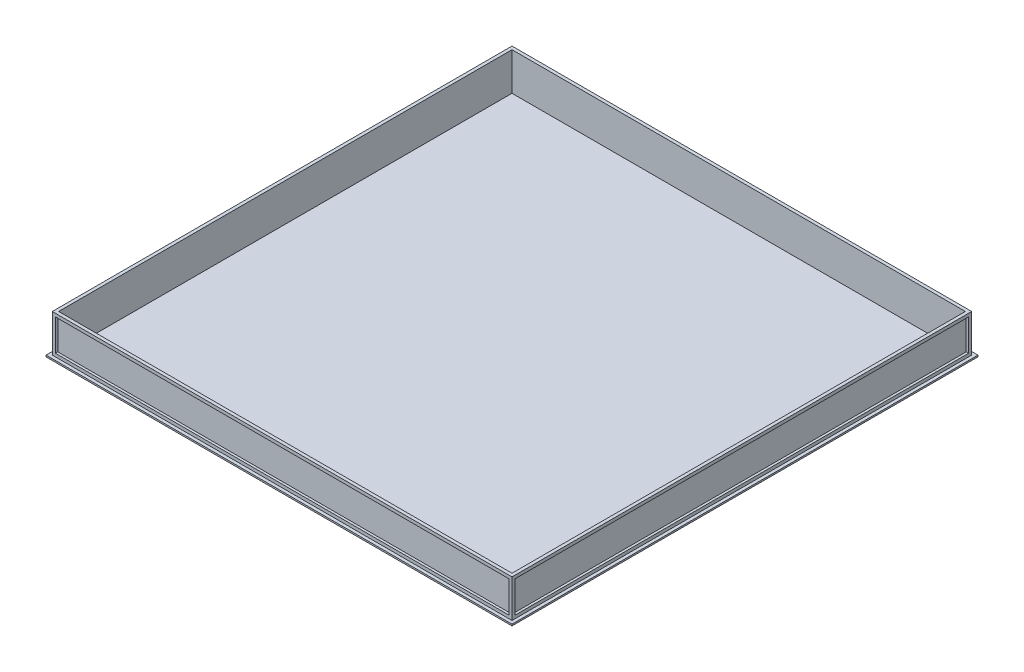
ISO-10303-21;
HEADER;
FILE_DESCRIPTION(('STEP AP214'),'2;1');
FILE_NAME('part.step','',(''),(''),'','','');
FILE_SCHEMA(('AUTOMOTIVE_DESIGN { 1 0 10303 214 1 1 1 1 }'));
ENDSEC;
DATA;
#1=APPLICATION_CONTEXT('core data for automotive mechanical design processes');
#2=APPLICATION_PROTOCOL_DEFINITION('international standard','automotive_design',2000,#1);
#3=PRODUCT_CONTEXT('',#1,'mechanical');
#4=PRODUCT('Part','Part','',(#3));
#5=PRODUCT_RELATED_PRODUCT_CATEGORY('part','',(#4));
#6=PRODUCT_DEFINITION_FORMATION('','',#4);
#7=PRODUCT_DEFINITION_CONTEXT('part definition',#1,'design');
#8=PRODUCT_DEFINITION('design','',#6,#7);
#9=PRODUCT_DEFINITION_SHAPE('','',#8);
#10=(LENGTH_UNIT() NAMED_UNIT(*) SI_UNIT(.MILLI.,.METRE.));
#11=(NAMED_UNIT(*) PLANE_ANGLE_UNIT() SI_UNIT($,.RADIAN.));
#12=(NAMED_UNIT(*) SI_UNIT($,.STERADIAN.) SOLID_ANGLE_UNIT());
#13=UNCERTAINTY_MEASURE_WITH_UNIT(LENGTH_MEASURE(1.E-05),#10,'distance_accuracy_value','');
#14=(GEOMETRIC_REPRESENTATION_CONTEXT(3) GLOBAL_UNCERTAINTY_ASSIGNED_CONTEXT((#13)) GLOBAL_UNIT_ASSIGNED_CONTEXT((#10,
#11,#12)) REPRESENTATION_CONTEXT('',''));
#15=CARTESIAN_POINT('',(0.,0.,0.));
#16=DIRECTION('',(0.,0.,1.));
#17=DIRECTION('',(1.,0.,0.));
#18=AXIS2_PLACEMENT_3D('',#15,#16,#17);
#19=CARTESIAN_POINT('',(-1879.6,-12.7,-1879.6));
#20=DIRECTION('',(0.,1.,0.));
#21=DIRECTION('',(0.,0.,1.));
#22=AXIS2_PLACEMENT_3D('',#19,#20,#21);
#23=PLANE('',#22);
#24=DIRECTION('',(1.,0.,0.));
#25=VECTOR('',#24,1.);
#26=CARTESIAN_POINT('',(0.,-12.7,1879.6));
#27=LINE('',#26,#25);
#28=CARTESIAN_POINT('',(-1879.6,-12.7,1879.6));
#29=VERTEX_POINT('',#28);
#30=CARTESIAN_POINT('',(1879.6,-12.7,1879.6));
#31=VERTEX_POINT('',#30);
#32=EDGE_CURVE('E213',#29,#31,#27,.T.);
#33=ORIENTED_EDGE('',*,*,#32,.F.);
#34=DIRECTION('',(0.,0.,1.));
#35=VECTOR('',#34,1.);
#36=CARTESIAN_POINT('',(-1879.6,-12.7,0.));
#37=LINE('',#36,#35);
#38=CARTESIAN_POINT('',(-1879.6,-12.7,-1879.6));
#39=VERTEX_POINT('',#38);
#40=EDGE_CURVE('E200',#39,#29,#37,.T.);
#41=ORIENTED_EDGE('',*,*,#40,.F.);
#42=DIRECTION('',(-1.,0.,0.));
#43=VECTOR('',#42,1.);
#44=CARTESIAN_POINT('',(0.,-12.7,-1879.6));
#45=LINE('',#44,#43);
#46=CARTESIAN_POINT('',(1879.6,-12.7,-1879.6));
#47=VERTEX_POINT('',#46);
#48=EDGE_CURVE('E21',#47,#39,#45,.T.);
#49=ORIENTED_EDGE('',*,*,#48,.F.);
#50=DIRECTION('',(0.,0.,-1.));
#51=VECTOR('',#50,1.);
#52=CARTESIAN_POINT('',(1879.6,-12.7,0.));
#53=LINE('',#52,#51);
#54=EDGE_CURVE('E228',#31,#47,#53,.T.);
#55=ORIENTED_EDGE('',*,*,#54,.F.);
#56=EDGE_LOOP('',(#33,#41,#49,#55));
#57=FACE_BOUND('',#56,.T.);
#58=ADVANCED_FACE('F17',(#57),#23,.F.);
#59=CARTESIAN_POINT('',(-1828.8,25.4,1835.15));
#60=DIRECTION('',(0.,0.,1.));
#61=DIRECTION('',(1.,0.,0.));
#62=AXIS2_PLACEMENT_3D('',#59,#60,#61);
#63=PLANE('',#62);
#64=DIRECTION('',(1.,0.,0.));
#65=VECTOR('',#64,1.);
#66=CARTESIAN_POINT('',(0.,25.4,1835.15));
#67=LINE('',#66,#65);
#68=CARTESIAN_POINT('',(-1828.8,25.4,1835.15));
#69=VERTEX_POINT('',#68);
#70=CARTESIAN_POINT('',(1828.8,25.4,1835.15));
#71=VERTEX_POINT('',#70);
#72=EDGE_CURVE('E230',#69,#71,#67,.T.);
#73=ORIENTED_EDGE('',*,*,#72,.T.);
#74=DIRECTION('',(0.,-1.,0.));
#75=VECTOR('',#74,1.);
#76=CARTESIAN_POINT('',(1828.8,152.4,1835.15));
#77=LINE('',#76,#75);
#78=CARTESIAN_POINT('',(1828.8,279.4,1835.15));
#79=VERTEX_POINT('',#78);
#80=EDGE_CURVE('E248',#79,#71,#77,.T.);
#81=ORIENTED_EDGE('',*,*,#80,.F.);
#82=DIRECTION('',(-1.,0.,0.));
#83=VECTOR('',#82,1.);
#84=CARTESIAN_POINT('',(0.,279.4,1835.15));
#85=LINE('',#84,#83);
#86=CARTESIAN_POINT('',(-1828.8,279.4,1835.15));
#87=VERTEX_POINT('',#86);
#88=EDGE_CURVE('E238',#79,#87,#85,.T.);
#89=ORIENTED_EDGE('',*,*,#88,.T.);
#90=DIRECTION('',(0.,1.,0.));
#91=VECTOR('',#90,1.);
#92=CARTESIAN_POINT('',(-1828.8,152.4,1835.15));
#93=LINE('',#92,#91);
#94=EDGE_CURVE('E232',#69,#87,#93,.T.);
#95=ORIENTED_EDGE('',*,*,#94,.F.);
#96=EDGE_LOOP('',(#73,#81,#89,#95));
#97=FACE_BOUND('',#96,.T.);
#98=ADVANCED_FACE('F757',(#97),#63,.T.);
#99=CARTESIAN_POINT('',(1835.15,25.4,1828.8));
#100=DIRECTION('',(1.,0.,0.));
#101=DIRECTION('',(0.,0.,-1.));
#102=AXIS2_PLACEMENT_3D('',#99,#100,#101);
#103=PLANE('',#102);
#104=DIRECTION('',(0.,0.,-1.));
#105=VECTOR('',#104,1.);
#106=CARTESIAN_POINT('',(1835.15,25.4,0.));
#107=LINE('',#106,#105);
#108=CARTESIAN_POINT('',(1835.15,25.4,1828.8));
#109=VERTEX_POINT('',#108);
#110=CARTESIAN_POINT('',(1835.15,25.4,-1828.8));
#111=VERTEX_POINT('',#110);
#112=EDGE_CURVE('E254',#109,#111,#107,.T.);
#113=ORIENTED_EDGE('',*,*,#112,.T.);
#114=DIRECTION('',(0.,-1.,0.));
#115=VECTOR('',#114,1.);
#116=CARTESIAN_POINT('',(1835.15,152.4,-1828.8));
#117=LINE('',#116,#115);
#118=CARTESIAN_POINT('',(1835.15,279.4,-1828.8));
#119=VERTEX_POINT('',#118);
#120=EDGE_CURVE('E251',#119,#111,#117,.T.);
#121=ORIENTED_EDGE('',*,*,#120,.F.);
#122=DIRECTION('',(0.,0.,1.));
#123=VECTOR('',#122,1.);
#124=CARTESIAN_POINT('',(1835.15,279.4,0.));
#125=LINE('',#124,#123);
#126=CARTESIAN_POINT('',(1835.15,279.4,1828.8));
#127=VERTEX_POINT('',#126);
#128=EDGE_CURVE('E264',#119,#127,#125,.T.);
#129=ORIENTED_EDGE('',*,*,#128,.T.);
#130=DIRECTION('',(0.,1.,0.));
#131=VECTOR('',#130,1.);
#132=CARTESIAN_POINT('',(1835.15,152.4,1828.8));
#133=LINE('',#132,#131);
#134=EDGE_CURVE('E261',#109,#127,#133,.T.);
#135=ORIENTED_EDGE('',*,*,#134,.F.);
#136=EDGE_LOOP('',(#113,#121,#129,#135));
#137=FACE_BOUND('',#136,.T.);
#138=ADVANCED_FACE('F747',(#137),#103,.T.);
#139=CARTESIAN_POINT('',(1828.8,25.4,-1835.15));
#140=DIRECTION('',(0.,0.,-1.));
#141=DIRECTION('',(-1.,0.,0.));
#142=AXIS2_PLACEMENT_3D('',#139,#140,#141);
#143=PLANE('',#142);
#144=DIRECTION('',(-1.,0.,0.));
#145=VECTOR('',#144,1.);
#146=CARTESIAN_POINT('',(0.,25.4,-1835.15));
#147=LINE('',#146,#145);
#148=CARTESIAN_POINT('',(1828.8,25.4,-1835.15));
#149=VERTEX_POINT('',#148);
#150=CARTESIAN_POINT('',(-1828.8,25.4,-1835.15));
#151=VERTEX_POINT('',#150);
#152=EDGE_CURVE('E274',#149,#151,#147,.T.);
#153=ORIENTED_EDGE('',*,*,#152,.T.);
#154=DIRECTION('',(0.,-1.,0.));
#155=VECTOR('',#154,1.);
#156=CARTESIAN_POINT('',(-1828.8,152.4,-1835.15));
#157=LINE('',#156,#155);
#158=CARTESIAN_POINT('',(-1828.8,279.4,-1835.15));
#159=VERTEX_POINT('',#158);
#160=EDGE_CURVE('E271',#159,#151,#157,.T.);
#161=ORIENTED_EDGE('',*,*,#160,.F.);
#162=DIRECTION('',(1.,0.,0.));
#163=VECTOR('',#162,1.);
#164=CARTESIAN_POINT('',(0.,279.4,-1835.15));
#165=LINE('',#164,#163);
#166=CARTESIAN_POINT('',(1828.8,279.4,-1835.15));
#167=VERTEX_POINT('',#166);
#168=EDGE_CURVE('E284',#159,#167,#165,.T.);
#169=ORIENTED_EDGE('',*,*,#168,.T.);
#170=DIRECTION('',(0.,1.,0.));
#171=VECTOR('',#170,1.);
#172=CARTESIAN_POINT('',(1828.8,152.4,-1835.15));
#173=LINE('',#172,#171);
#174=EDGE_CURVE('E281',#149,#167,#173,.T.);
#175=ORIENTED_EDGE('',*,*,#174,.F.);
#176=EDGE_LOOP('',(#153,#161,#169,#175));
#177=FACE_BOUND('',#176,.T.);
#178=ADVANCED_FACE('F738',(#177),#143,.T.);
#179=CARTESIAN_POINT('',(1879.6,-12.7,-1879.6));
#180=DIRECTION('',(0.,0.,-1.));
#181=DIRECTION('',(-1.,0.,0.));
#182=AXIS2_PLACEMENT_3D('',#179,#180,#181);
#183=PLANE('',#182);
#184=DIRECTION('',(0.,1.,0.));
#185=VECTOR('',#184,1.);
#186=CARTESIAN_POINT('',(1879.6,-6.35,-1879.6));
#187=LINE('',#186,#185);
#188=CARTESIAN_POINT('',(1879.6,0.,-1879.6));
#189=VERTEX_POINT('',#188);
#190=EDGE_CURVE('E209',#47,#189,#187,.T.);
#191=ORIENTED_EDGE('',*,*,#190,.F.);
#192=ORIENTED_EDGE('',*,*,#48,.T.);
#193=DIRECTION('',(0.,-1.,0.));
#194=VECTOR('',#193,1.);
#195=CARTESIAN_POINT('',(-1879.6,-6.35,-1879.6));
#196=LINE('',#195,#194);
#197=CARTESIAN_POINT('',(-1879.6,0.,-1879.6));
#198=VERTEX_POINT('',#197);
#199=EDGE_CURVE('E206',#198,#39,#196,.T.);
#200=ORIENTED_EDGE('',*,*,#199,.F.);
#201=DIRECTION('',(-1.,0.,0.));
#202=VECTOR('',#201,1.);
#203=CARTESIAN_POINT('',(0.,0.,-1879.6));
#204=LINE('',#203,#202);
#205=EDGE_CURVE('E291',#189,#198,#204,.T.);
#206=ORIENTED_EDGE('',*,*,#205,.F.);
#207=EDGE_LOOP('',(#191,#192,#200,#206));
#208=FACE_BOUND('',#207,.T.);
#209=ADVANCED_FACE('F205',(#208),#183,.T.);
#210=CARTESIAN_POINT('',(-1879.6,-12.7,-1879.6));
#211=DIRECTION('',(-1.,0.,0.));
#212=DIRECTION('',(0.,0.,1.));
#213=AXIS2_PLACEMENT_3D('',#210,#211,#212);
#214=PLANE('',#213);
#215=ORIENTED_EDGE('',*,*,#199,.T.);
#216=ORIENTED_EDGE('',*,*,#40,.T.);
#217=DIRECTION('',(0.,-1.,0.));
#218=VECTOR('',#217,1.);
#219=CARTESIAN_POINT('',(-1879.6,-6.35,1879.6));
#220=LINE('',#219,#218);
#221=CARTESIAN_POINT('',(-1879.6,0.,1879.6));
#222=VERTEX_POINT('',#221);
#223=EDGE_CURVE('E215',#222,#29,#220,.T.);
#224=ORIENTED_EDGE('',*,*,#223,.F.);
#225=DIRECTION('',(0.,0.,1.));
#226=VECTOR('',#225,1.);
#227=CARTESIAN_POINT('',(-1879.6,0.,0.));
#228=LINE('',#227,#226);
#229=EDGE_CURVE('E219',#198,#222,#228,.T.);
#230=ORIENTED_EDGE('',*,*,#229,.F.);
#231=EDGE_LOOP('',(#215,#216,#224,#230));
#232=FACE_BOUND('',#231,.T.);
#233=ADVANCED_FACE('F217',(#232),#214,.T.);
#234=CARTESIAN_POINT('',(-1879.6,-12.7,1879.6));
#235=DIRECTION('',(0.,0.,1.));
#236=DIRECTION('',(1.,0.,0.));
#237=AXIS2_PLACEMENT_3D('',#234,#235,#236);
#238=PLANE('',#237);
#239=ORIENTED_EDGE('',*,*,#223,.T.);
#240=ORIENTED_EDGE('',*,*,#32,.T.);
#241=DIRECTION('',(0.,-1.,0.));
#242=VECTOR('',#241,1.);
#243=CARTESIAN_POINT('',(1879.6,-6.35,1879.6));
#244=LINE('',#243,#242);
#245=CARTESIAN_POINT('',(1879.6,0.,1879.6));
#246=VERTEX_POINT('',#245);
#247=EDGE_CURVE('E225',#246,#31,#244,.T.);
#248=ORIENTED_EDGE('',*,*,#247,.F.);
#249=DIRECTION('',(1.,0.,0.));
#250=VECTOR('',#249,1.);
#251=CARTESIAN_POINT('',(0.,0.,1879.6));
#252=LINE('',#251,#250);
#253=EDGE_CURVE('E294',#222,#246,#252,.T.);
#254=ORIENTED_EDGE('',*,*,#253,.F.);
#255=EDGE_LOOP('',(#239,#240,#248,#254));
#256=FACE_BOUND('',#255,.T.);
#257=ADVANCED_FACE('F711',(#256),#238,.T.);
#258=CARTESIAN_POINT('',(1879.6,-12.7,1879.6));
#259=DIRECTION('',(1.,0.,0.));
#260=DIRECTION('',(0.,0.,-1.));
#261=AXIS2_PLACEMENT_3D('',#258,#259,#260);
#262=PLANE('',#261);
#263=ORIENTED_EDGE('',*,*,#247,.T.);
#264=ORIENTED_EDGE('',*,*,#54,.T.);
#265=ORIENTED_EDGE('',*,*,#190,.T.);
#266=DIRECTION('',(0.,0.,-1.));
#267=VECTOR('',#266,1.);
#268=CARTESIAN_POINT('',(1879.6,0.,0.));
#269=LINE('',#268,#267);
#270=EDGE_CURVE('E297',#246,#189,#269,.T.);
#271=ORIENTED_EDGE('',*,*,#270,.F.);
#272=EDGE_LOOP('',(#263,#264,#265,#271));
#273=FACE_BOUND('',#272,.T.);
#274=ADVANCED_FACE('F701',(#273),#262,.T.);
#275=CARTESIAN_POINT('',(-1835.15,25.4,-1828.8));
#276=DIRECTION('',(-1.,0.,0.));
#277=DIRECTION('',(0.,0.,1.));
#278=AXIS2_PLACEMENT_3D('',#275,#276,#277);
#279=PLANE('',#278);
#280=DIRECTION('',(0.,0.,1.));
#281=VECTOR('',#280,1.);
#282=CARTESIAN_POINT('',(-1835.15,25.4,0.));
#283=LINE('',#282,#281);
#284=CARTESIAN_POINT('',(-1835.15,25.4,-1828.8));
#285=VERTEX_POINT('',#284);
#286=CARTESIAN_POINT('',(-1835.15,25.4,1828.8));
#287=VERTEX_POINT('',#286);
#288=EDGE_CURVE('E303',#285,#287,#283,.T.);
#289=ORIENTED_EDGE('',*,*,#288,.T.);
#290=DIRECTION('',(0.,-1.,0.));
#291=VECTOR('',#290,1.);
#292=CARTESIAN_POINT('',(-1835.15,152.4,1828.8));
#293=LINE('',#292,#291);
#294=CARTESIAN_POINT('',(-1835.15,279.4,1828.8));
#295=VERTEX_POINT('',#294);
#296=EDGE_CURVE('E300',#295,#287,#293,.T.);
#297=ORIENTED_EDGE('',*,*,#296,.F.);
#298=DIRECTION('',(0.,0.,-1.));
#299=VECTOR('',#298,1.);
#300=CARTESIAN_POINT('',(-1835.15,279.4,0.));
#301=LINE('',#300,#299);
#302=CARTESIAN_POINT('',(-1835.15,279.4,-1828.8));
#303=VERTEX_POINT('',#302);
#304=EDGE_CURVE('E313',#295,#303,#301,.T.);
#305=ORIENTED_EDGE('',*,*,#304,.T.);
#306=DIRECTION('',(0.,1.,0.));
#307=VECTOR('',#306,1.);
#308=CARTESIAN_POINT('',(-1835.15,152.4,-1828.8));
#309=LINE('',#308,#307);
#310=EDGE_CURVE('E310',#285,#303,#309,.T.);
#311=ORIENTED_EDGE('',*,*,#310,.F.);
#312=EDGE_LOOP('',(#289,#297,#305,#311));
#313=FACE_BOUND('',#312,.T.);
#314=ADVANCED_FACE('F691',(#313),#279,.T.);
#315=CARTESIAN_POINT('',(-1828.8,25.4,1854.2));
#316=DIRECTION('',(0.,-1.,0.));
#317=DIRECTION('',(0.,0.,-1.));
#318=AXIS2_PLACEMENT_3D('',#315,#316,#317);
#319=PLANE('',#318);
#320=ORIENTED_EDGE('',*,*,#72,.F.);
#321=DIRECTION('',(0.,0.,-1.));
#322=VECTOR('',#321,1.);
#323=CARTESIAN_POINT('',(-1828.8,25.4,1844.675));
#324=LINE('',#323,#322);
#325=CARTESIAN_POINT('',(-1828.8000000635,25.3999999746,1854.2));
#326=VERTEX_POINT('',#325);
#327=EDGE_CURVE('E235',#326,#69,#324,.T.);
#328=ORIENTED_EDGE('',*,*,#327,.F.);
#329=DIRECTION('',(-1.,0.,0.));
#330=VECTOR('',#329,1.);
#331=CARTESIAN_POINT('',(0.,25.3999998984,1854.2));
#332=LINE('',#331,#330);
#333=CARTESIAN_POINT('',(1828.8000000635,25.3999999746,1854.2));
#334=VERTEX_POINT('',#333);
#335=EDGE_CURVE('E322',#334,#326,#332,.T.);
#336=ORIENTED_EDGE('',*,*,#335,.F.);
#337=DIRECTION('',(0.,0.,1.));
#338=VECTOR('',#337,1.);
#339=CARTESIAN_POINT('',(1828.8,25.4,1844.675));
#340=LINE('',#339,#338);
#341=EDGE_CURVE('E242',#71,#334,#340,.T.);
#342=ORIENTED_EDGE('',*,*,#341,.F.);
#343=EDGE_LOOP('',(#320,#328,#336,#342));
#344=FACE_BOUND('',#343,.T.);
#345=ADVANCED_FACE('F681',(#344),#319,.F.);
#346=CARTESIAN_POINT('',(-1828.8,25.4,1854.2));
#347=DIRECTION('',(1.,0.,0.));
#348=DIRECTION('',(0.,0.,-1.));
#349=AXIS2_PLACEMENT_3D('',#346,#347,#348);
#350=PLANE('',#349);
#351=DIRECTION('',(0.,1.,0.));
#352=VECTOR('',#351,1.);
#353=CARTESIAN_POINT('',(-1828.800000254,152.4,1854.2));
#354=LINE('',#353,#352);
#355=CARTESIAN_POINT('',(-1828.8000000635,279.4000000254,1854.2));
#356=VERTEX_POINT('',#355);
#357=EDGE_CURVE('E325',#326,#356,#354,.T.);
#358=ORIENTED_EDGE('',*,*,#357,.F.);
#359=ORIENTED_EDGE('',*,*,#327,.T.);
#360=ORIENTED_EDGE('',*,*,#94,.T.);
#361=DIRECTION('',(0.,0.,1.));
#362=VECTOR('',#361,1.);
#363=CARTESIAN_POINT('',(-1828.8,279.4,1844.675));
#364=LINE('',#363,#362);
#365=EDGE_CURVE('E240',#87,#356,#364,.T.);
#366=ORIENTED_EDGE('',*,*,#365,.T.);
#367=EDGE_LOOP('',(#358,#359,#360,#366));
#368=FACE_BOUND('',#367,.T.);
#369=ADVANCED_FACE('F671',(#368),#350,.T.);
#370=CARTESIAN_POINT('',(-1828.8,279.4,1835.15));
#371=DIRECTION('',(0.,1.,0.));
#372=DIRECTION('',(0.,0.,1.));
#373=AXIS2_PLACEMENT_3D('',#370,#371,#372);
#374=PLANE('',#373);
#375=DIRECTION('',(1.,0.,0.));
#376=VECTOR('',#375,1.);
#377=CARTESIAN_POINT('',(0.,279.4000001016,1854.2));
#378=LINE('',#377,#376);
#379=CARTESIAN_POINT('',(1828.8000000635,279.4000000254,1854.2));
#380=VERTEX_POINT('',#379);
#381=EDGE_CURVE('E328',#356,#380,#378,.T.);
#382=ORIENTED_EDGE('',*,*,#381,.F.);
#383=ORIENTED_EDGE('',*,*,#365,.F.);
#384=ORIENTED_EDGE('',*,*,#88,.F.);
#385=DIRECTION('',(0.,0.,-1.));
#386=VECTOR('',#385,1.);
#387=CARTESIAN_POINT('',(1828.8,279.4,1844.675));
#388=LINE('',#387,#386);
#389=EDGE_CURVE('E245',#380,#79,#388,.T.);
#390=ORIENTED_EDGE('',*,*,#389,.F.);
#391=EDGE_LOOP('',(#382,#383,#384,#390));
#392=FACE_BOUND('',#391,.T.);
#393=ADVANCED_FACE('F661',(#392),#374,.F.);
#394=CARTESIAN_POINT('',(1828.8,25.4,1835.15));
#395=DIRECTION('',(-1.,0.,0.));
#396=DIRECTION('',(0.,0.,1.));
#397=AXIS2_PLACEMENT_3D('',#394,#395,#396);
#398=PLANE('',#397);
#399=ORIENTED_EDGE('',*,*,#389,.T.);
#400=ORIENTED_EDGE('',*,*,#80,.T.);
#401=ORIENTED_EDGE('',*,*,#341,.T.);
#402=DIRECTION('',(0.,-1.,0.));
#403=VECTOR('',#402,1.);
#404=CARTESIAN_POINT('',(1828.800000254,152.4,1854.2));
#405=LINE('',#404,#403);
#406=EDGE_CURVE('E331',#380,#334,#405,.T.);
#407=ORIENTED_EDGE('',*,*,#406,.F.);
#408=EDGE_LOOP('',(#399,#400,#401,#407));
#409=FACE_BOUND('',#408,.T.);
#410=ADVANCED_FACE('F651',(#409),#398,.T.);
#411=CARTESIAN_POINT('',(1835.15,25.4,-1828.8));
#412=DIRECTION('',(0.,0.,1.));
#413=DIRECTION('',(1.,0.,0.));
#414=AXIS2_PLACEMENT_3D('',#411,#412,#413);
#415=PLANE('',#414);
#416=DIRECTION('',(-1.,0.,0.));
#417=VECTOR('',#416,1.);
#418=CARTESIAN_POINT('',(1844.675,279.4,-1828.8));
#419=LINE('',#418,#417);
#420=CARTESIAN_POINT('',(1854.2,279.4000000254,-1828.8000000635));
#421=VERTEX_POINT('',#420);
#422=EDGE_CURVE('E268',#421,#119,#419,.T.);
#423=ORIENTED_EDGE('',*,*,#422,.T.);
#424=ORIENTED_EDGE('',*,*,#120,.T.);
#425=DIRECTION('',(1.,0.,0.));
#426=VECTOR('',#425,1.);
#427=CARTESIAN_POINT('',(1844.675,25.4,-1828.8));
#428=LINE('',#427,#426);
#429=CARTESIAN_POINT('',(1854.2,25.3999999746,-1828.8000000635));
#430=VERTEX_POINT('',#429);
#431=EDGE_CURVE('E256',#111,#430,#428,.T.);
#432=ORIENTED_EDGE('',*,*,#431,.T.);
#433=DIRECTION('',(0.,-1.,0.));
#434=VECTOR('',#433,1.);
#435=CARTESIAN_POINT('',(1854.2,152.4,-1828.800000254));
#436=LINE('',#435,#434);
#437=EDGE_CURVE('E339',#421,#430,#436,.T.);
#438=ORIENTED_EDGE('',*,*,#437,.F.);
#439=EDGE_LOOP('',(#423,#424,#432,#438));
#440=FACE_BOUND('',#439,.T.);
#441=ADVANCED_FACE('F641',(#440),#415,.T.);
#442=CARTESIAN_POINT('',(1835.15,25.4,-1828.8));
#443=DIRECTION('',(0.,-1.,0.));
#444=DIRECTION('',(1.,0.,0.));
#445=AXIS2_PLACEMENT_3D('',#442,#443,#444);
#446=PLANE('',#445);
#447=ORIENTED_EDGE('',*,*,#112,.F.);
#448=DIRECTION('',(-1.,0.,0.));
#449=VECTOR('',#448,1.);
#450=CARTESIAN_POINT('',(1844.675,25.4,1828.8));
#451=LINE('',#450,#449);
#452=CARTESIAN_POINT('',(1854.2,25.3999999746,1828.8000000635));
#453=VERTEX_POINT('',#452);
#454=EDGE_CURVE('E258',#453,#109,#451,.T.);
#455=ORIENTED_EDGE('',*,*,#454,.F.);
#456=DIRECTION('',(0.,0.,1.));
#457=VECTOR('',#456,1.);
#458=CARTESIAN_POINT('',(1854.2,25.3999998984,0.));
#459=LINE('',#458,#457);
#460=EDGE_CURVE('E342',#430,#453,#459,.T.);
#461=ORIENTED_EDGE('',*,*,#460,.F.);
#462=ORIENTED_EDGE('',*,*,#431,.F.);
#463=EDGE_LOOP('',(#447,#455,#461,#462));
#464=FACE_BOUND('',#463,.T.);
#465=ADVANCED_FACE('F631',(#464),#446,.F.);
#466=CARTESIAN_POINT('',(1854.2,25.4,1828.8));
#467=DIRECTION('',(0.,0.,-1.));
#468=DIRECTION('',(-1.,0.,0.));
#469=AXIS2_PLACEMENT_3D('',#466,#467,#468);
#470=PLANE('',#469);
#471=DIRECTION('',(1.,0.,0.));
#472=VECTOR('',#471,1.);
#473=CARTESIAN_POINT('',(1844.675,279.4,1828.8));
#474=LINE('',#473,#472);
#475=CARTESIAN_POINT('',(1854.2,279.4000000254,1828.8000000635));
#476=VERTEX_POINT('',#475);
#477=EDGE_CURVE('E266',#127,#476,#474,.T.);
#478=ORIENTED_EDGE('',*,*,#477,.T.);
#479=DIRECTION('',(0.,1.,0.));
#480=VECTOR('',#479,1.);
#481=CARTESIAN_POINT('',(1854.2,152.4,1828.800000254));
#482=LINE('',#481,#480);
#483=EDGE_CURVE('E345',#453,#476,#482,.T.);
#484=ORIENTED_EDGE('',*,*,#483,.F.);
#485=ORIENTED_EDGE('',*,*,#454,.T.);
#486=ORIENTED_EDGE('',*,*,#134,.T.);
#487=EDGE_LOOP('',(#478,#484,#485,#486));
#488=FACE_BOUND('',#487,.T.);
#489=ADVANCED_FACE('F621',(#488),#470,.T.);
#490=CARTESIAN_POINT('',(1835.15,279.4,-1828.8));
#491=DIRECTION('',(0.,1.,0.));
#492=DIRECTION('',(0.,0.,1.));
#493=AXIS2_PLACEMENT_3D('',#490,#491,#492);
#494=PLANE('',#493);
#495=DIRECTION('',(0.,0.,-1.));
#496=VECTOR('',#495,1.);
#497=CARTESIAN_POINT('',(1854.2,279.4000001016,0.));
#498=LINE('',#497,#496);
#499=EDGE_CURVE('E348',#476,#421,#498,.T.);
#500=ORIENTED_EDGE('',*,*,#499,.F.);
#501=ORIENTED_EDGE('',*,*,#477,.F.);
#502=ORIENTED_EDGE('',*,*,#128,.F.);
#503=ORIENTED_EDGE('',*,*,#422,.F.);
#504=EDGE_LOOP('',(#500,#501,#502,#503));
#505=FACE_BOUND('',#504,.T.);
#506=ADVANCED_FACE('F611',(#505),#494,.F.);
#507=CARTESIAN_POINT('',(-1828.8,25.4,-1835.15));
#508=DIRECTION('',(1.,0.,0.));
#509=DIRECTION('',(0.,0.,-1.));
#510=AXIS2_PLACEMENT_3D('',#507,#508,#509);
#511=PLANE('',#510);
#512=DIRECTION('',(0.,0.,1.));
#513=VECTOR('',#512,1.);
#514=CARTESIAN_POINT('',(-1828.8,279.4,-1844.675));
#515=LINE('',#514,#513);
#516=CARTESIAN_POINT('',(-1828.8000000635,279.4000000254,-1854.2));
#517=VERTEX_POINT('',#516);
#518=EDGE_CURVE('E288',#517,#159,#515,.T.);
#519=ORIENTED_EDGE('',*,*,#518,.T.);
#520=ORIENTED_EDGE('',*,*,#160,.T.);
#521=DIRECTION('',(0.,0.,-1.));
#522=VECTOR('',#521,1.);
#523=CARTESIAN_POINT('',(-1828.8,25.4,-1844.675));
#524=LINE('',#523,#522);
#525=CARTESIAN_POINT('',(-1828.8000000635,25.3999999746,-1854.2));
#526=VERTEX_POINT('',#525);
#527=EDGE_CURVE('E276',#151,#526,#524,.T.);
#528=ORIENTED_EDGE('',*,*,#527,.T.);
#529=DIRECTION('',(0.,-1.,0.));
#530=VECTOR('',#529,1.);
#531=CARTESIAN_POINT('',(-1828.800000254,152.4,-1854.2));
#532=LINE('',#531,#530);
#533=EDGE_CURVE('E356',#517,#526,#532,.T.);
#534=ORIENTED_EDGE('',*,*,#533,.F.);
#535=EDGE_LOOP('',(#519,#520,#528,#534));
#536=FACE_BOUND('',#535,.T.);
#537=ADVANCED_FACE('F601',(#536),#511,.T.);
#538=CARTESIAN_POINT('',(-1828.8,25.4,-1835.15));
#539=DIRECTION('',(0.,-1.,0.));
#540=DIRECTION('',(0.,0.,-1.));
#541=AXIS2_PLACEMENT_3D('',#538,#539,#540);
#542=PLANE('',#541);
#543=ORIENTED_EDGE('',*,*,#152,.F.);
#544=DIRECTION('',(0.,0.,1.));
#545=VECTOR('',#544,1.);
#546=CARTESIAN_POINT('',(1828.8,25.4,-1844.675));
#547=LINE('',#546,#545);
#548=CARTESIAN_POINT('',(1828.8000000635,25.3999999746,-1854.2));
#549=VERTEX_POINT('',#548);
#550=EDGE_CURVE('E278',#549,#149,#547,.T.);
#551=ORIENTED_EDGE('',*,*,#550,.F.);
#552=DIRECTION('',(1.,0.,0.));
#553=VECTOR('',#552,1.);
#554=CARTESIAN_POINT('',(0.,25.3999998984,-1854.2));
#555=LINE('',#554,#553);
#556=EDGE_CURVE('E359',#526,#549,#555,.T.);
#557=ORIENTED_EDGE('',*,*,#556,.F.);
#558=ORIENTED_EDGE('',*,*,#527,.F.);
#559=EDGE_LOOP('',(#543,#551,#557,#558));
#560=FACE_BOUND('',#559,.T.);
#561=ADVANCED_FACE('F591',(#560),#542,.F.);
#562=CARTESIAN_POINT('',(1828.8,25.4,-1854.2));
#563=DIRECTION('',(-1.,0.,0.));
#564=DIRECTION('',(0.,0.,1.));
#565=AXIS2_PLACEMENT_3D('',#562,#563,#564);
#566=PLANE('',#565);
#567=ORIENTED_EDGE('',*,*,#174,.T.);
#568=DIRECTION('',(0.,0.,-1.));
#569=VECTOR('',#568,1.);
#570=CARTESIAN_POINT('',(1828.8,279.4,-1844.675));
#571=LINE('',#570,#569);
#572=CARTESIAN_POINT('',(1828.8000000635,279.4000000254,-1854.2));
#573=VERTEX_POINT('',#572);
#574=EDGE_CURVE('E286',#167,#573,#571,.T.);
#575=ORIENTED_EDGE('',*,*,#574,.T.);
#576=DIRECTION('',(0.,1.,0.));
#577=VECTOR('',#576,1.);
#578=CARTESIAN_POINT('',(1828.800000254,152.4,-1854.2));
#579=LINE('',#578,#577);
#580=EDGE_CURVE('E362',#549,#573,#579,.T.);
#581=ORIENTED_EDGE('',*,*,#580,.F.);
#582=ORIENTED_EDGE('',*,*,#550,.T.);
#583=EDGE_LOOP('',(#567,#575,#581,#582));
#584=FACE_BOUND('',#583,.T.);
#585=ADVANCED_FACE('F581',(#584),#566,.T.);
#586=CARTESIAN_POINT('',(-1828.8,279.4,-1854.2));
#587=DIRECTION('',(0.,1.,0.));
#588=DIRECTION('',(0.,0.,1.));
#589=AXIS2_PLACEMENT_3D('',#586,#587,#588);
#590=PLANE('',#589);
#591=DIRECTION('',(-1.,0.,0.));
#592=VECTOR('',#591,1.);
#593=CARTESIAN_POINT('',(0.,279.4000001016,-1854.2));
#594=LINE('',#593,#592);
#595=EDGE_CURVE('E365',#573,#517,#594,.T.);
#596=ORIENTED_EDGE('',*,*,#595,.F.);
#597=ORIENTED_EDGE('',*,*,#574,.F.);
#598=ORIENTED_EDGE('',*,*,#168,.F.);
#599=ORIENTED_EDGE('',*,*,#518,.F.);
#600=EDGE_LOOP('',(#596,#597,#598,#599));
#601=FACE_BOUND('',#600,.T.);
#602=ADVANCED_FACE('F571',(#601),#590,.F.);
#603=CARTESIAN_POINT('',(-1879.6,0.,-1879.6));
#604=DIRECTION('',(0.,1.,0.));
#605=DIRECTION('',(0.,0.,1.));
#606=AXIS2_PLACEMENT_3D('',#603,#604,#605);
#607=PLANE('',#606);
#608=DIRECTION('',(1.,0.,0.));
#609=VECTOR('',#608,1.);
#610=CARTESIAN_POINT('',(0.,0.,1854.2));
#611=LINE('',#610,#609);
#612=CARTESIAN_POINT('',(-1854.1999995428,0.,1854.1999995428));
#613=VERTEX_POINT('',#612);
#614=CARTESIAN_POINT('',(1854.1999997714,0.,1854.1999997714));
#615=VERTEX_POINT('',#614);
#616=EDGE_CURVE('E320',#613,#615,#611,.T.);
#617=ORIENTED_EDGE('',*,*,#616,.F.);
#618=DIRECTION('',(0.,0.,1.));
#619=VECTOR('',#618,1.);
#620=CARTESIAN_POINT('',(-1854.2,0.,0.));
#621=LINE('',#620,#619);
#622=CARTESIAN_POINT('',(-1854.1999997714,0.,-1854.1999997714));
#623=VERTEX_POINT('',#622);
#624=EDGE_CURVE('E371',#623,#613,#621,.T.);
#625=ORIENTED_EDGE('',*,*,#624,.F.);
#626=DIRECTION('',(-1.,0.,0.));
#627=VECTOR('',#626,1.);
#628=CARTESIAN_POINT('',(0.,0.,-1854.2));
#629=LINE('',#628,#627);
#630=CARTESIAN_POINT('',(1854.1999997714,0.,-1854.1999997714));
#631=VERTEX_POINT('',#630);
#632=EDGE_CURVE('E354',#631,#623,#629,.T.);
#633=ORIENTED_EDGE('',*,*,#632,.F.);
#634=DIRECTION('',(0.,0.,-1.));
#635=VECTOR('',#634,1.);
#636=CARTESIAN_POINT('',(1854.2,0.,0.));
#637=LINE('',#636,#635);
#638=EDGE_CURVE('E337',#615,#631,#637,.T.);
#639=ORIENTED_EDGE('',*,*,#638,.F.);
#640=EDGE_LOOP('',(#617,#625,#633,#639));
#641=FACE_BOUND('',#640,.T.);
#642=ORIENTED_EDGE('',*,*,#253,.T.);
#643=ORIENTED_EDGE('',*,*,#270,.T.);
#644=ORIENTED_EDGE('',*,*,#205,.T.);
#645=ORIENTED_EDGE('',*,*,#229,.T.);
#646=EDGE_LOOP('',(#642,#643,#644,#645));
#647=FACE_BOUND('',#646,.T.);
#648=ADVANCED_FACE('F561',(#641,#647),#607,.T.);
#649=CARTESIAN_POINT('',(-1835.15,25.4,1828.8));
#650=DIRECTION('',(0.,0.,-1.));
#651=DIRECTION('',(-1.,0.,0.));
#652=AXIS2_PLACEMENT_3D('',#649,#650,#651);
#653=PLANE('',#652);
#654=DIRECTION('',(1.,0.,0.));
#655=VECTOR('',#654,1.);
#656=CARTESIAN_POINT('',(-1844.675,279.4,1828.8));
#657=LINE('',#656,#655);
#658=CARTESIAN_POINT('',(-1854.2,279.4000000254,1828.8000000635));
#659=VERTEX_POINT('',#658);
#660=EDGE_CURVE('E317',#659,#295,#657,.T.);
#661=ORIENTED_EDGE('',*,*,#660,.T.);
#662=ORIENTED_EDGE('',*,*,#296,.T.);
#663=DIRECTION('',(-1.,0.,0.));
#664=VECTOR('',#663,1.);
#665=CARTESIAN_POINT('',(-1844.675,25.4,1828.8));
#666=LINE('',#665,#664);
#667=CARTESIAN_POINT('',(-1854.2,25.3999999746,1828.8000000635));
#668=VERTEX_POINT('',#667);
#669=EDGE_CURVE('E305',#287,#668,#666,.T.);
#670=ORIENTED_EDGE('',*,*,#669,.T.);
#671=DIRECTION('',(0.,-1.,0.));
#672=VECTOR('',#671,1.);
#673=CARTESIAN_POINT('',(-1854.2,152.4,1828.800000254));
#674=LINE('',#673,#672);
#675=EDGE_CURVE('E377',#659,#668,#674,.T.);
#676=ORIENTED_EDGE('',*,*,#675,.F.);
#677=EDGE_LOOP('',(#661,#662,#670,#676));
#678=FACE_BOUND('',#677,.T.);
#679=ADVANCED_FACE('F551',(#678),#653,.T.);
#680=CARTESIAN_POINT('',(-1854.2,25.4,-1828.8));
#681=DIRECTION('',(0.,-1.,0.));
#682=DIRECTION('',(1.,0.,0.));
#683=AXIS2_PLACEMENT_3D('',#680,#681,#682);
#684=PLANE('',#683);
#685=ORIENTED_EDGE('',*,*,#288,.F.);
#686=DIRECTION('',(1.,0.,0.));
#687=VECTOR('',#686,1.);
#688=CARTESIAN_POINT('',(-1844.675,25.4,-1828.8));
#689=LINE('',#688,#687);
#690=CARTESIAN_POINT('',(-1854.2,25.3999999746,-1828.8000000635));
#691=VERTEX_POINT('',#690);
#692=EDGE_CURVE('E307',#691,#285,#689,.T.);
#693=ORIENTED_EDGE('',*,*,#692,.F.);
#694=DIRECTION('',(0.,0.,-1.));
#695=VECTOR('',#694,1.);
#696=CARTESIAN_POINT('',(-1854.2,25.3999998984,0.));
#697=LINE('',#696,#695);
#698=EDGE_CURVE('E380',#668,#691,#697,.T.);
#699=ORIENTED_EDGE('',*,*,#698,.F.);
#700=ORIENTED_EDGE('',*,*,#669,.F.);
#701=EDGE_LOOP('',(#685,#693,#699,#700));
#702=FACE_BOUND('',#701,.T.);
#703=ADVANCED_FACE('F541',(#702),#684,.F.);
#704=CARTESIAN_POINT('',(-1854.2,25.4,-1828.8));
#705=DIRECTION('',(0.,0.,1.));
#706=DIRECTION('',(1.,0.,0.));
#707=AXIS2_PLACEMENT_3D('',#704,#705,#706);
#708=PLANE('',#707);
#709=ORIENTED_EDGE('',*,*,#310,.T.);
#710=DIRECTION('',(-1.,0.,0.));
#711=VECTOR('',#710,1.);
#712=CARTESIAN_POINT('',(-1844.675,279.4,-1828.8));
#713=LINE('',#712,#711);
#714=CARTESIAN_POINT('',(-1854.2,279.4000000254,-1828.8000000635));
#715=VERTEX_POINT('',#714);
#716=EDGE_CURVE('E315',#303,#715,#713,.T.);
#717=ORIENTED_EDGE('',*,*,#716,.T.);
#718=DIRECTION('',(0.,1.,0.));
#719=VECTOR('',#718,1.);
#720=CARTESIAN_POINT('',(-1854.2,152.4,-1828.800000254));
#721=LINE('',#720,#719);
#722=EDGE_CURVE('E383',#691,#715,#721,.T.);
#723=ORIENTED_EDGE('',*,*,#722,.F.);
#724=ORIENTED_EDGE('',*,*,#692,.T.);
#725=EDGE_LOOP('',(#709,#717,#723,#724));
#726=FACE_BOUND('',#725,.T.);
#727=ADVANCED_FACE('F531',(#726),#708,.T.);
#728=CARTESIAN_POINT('',(-1854.2,279.4,-1828.8));
#729=DIRECTION('',(0.,1.,0.));
#730=DIRECTION('',(0.,0.,1.));
#731=AXIS2_PLACEMENT_3D('',#728,#729,#730);
#732=PLANE('',#731);
#733=DIRECTION('',(0.,0.,1.));
#734=VECTOR('',#733,1.);
#735=CARTESIAN_POINT('',(-1854.2,279.4000001016,0.));
#736=LINE('',#735,#734);
#737=EDGE_CURVE('E386',#715,#659,#736,.T.);
#738=ORIENTED_EDGE('',*,*,#737,.F.);
#739=ORIENTED_EDGE('',*,*,#716,.F.);
#740=ORIENTED_EDGE('',*,*,#304,.F.);
#741=ORIENTED_EDGE('',*,*,#660,.F.);
#742=EDGE_LOOP('',(#738,#739,#740,#741));
#743=FACE_BOUND('',#742,.T.);
#744=ADVANCED_FACE('F521',(#743),#732,.F.);
#745=CARTESIAN_POINT('',(-1854.2,0.,1854.2));
#746=DIRECTION('',(0.,0.,1.));
#747=DIRECTION('',(1.,0.,0.));
#748=AXIS2_PLACEMENT_3D('',#745,#746,#747);
#749=PLANE('',#748);
#750=ORIENTED_EDGE('',*,*,#381,.T.);
#751=ORIENTED_EDGE('',*,*,#406,.T.);
#752=ORIENTED_EDGE('',*,*,#335,.T.);
#753=ORIENTED_EDGE('',*,*,#357,.T.);
#754=EDGE_LOOP('',(#750,#751,#752,#753));
#755=FACE_BOUND('',#754,.T.);
#756=DIRECTION('',(0.,1.,0.));
#757=VECTOR('',#756,1.);
#758=CARTESIAN_POINT('',(-1854.2,152.4,1854.2));
#759=LINE('',#758,#757);
#760=CARTESIAN_POINT('',(-1854.2,304.8,1854.2));
#761=VERTEX_POINT('',#760);
#762=EDGE_CURVE('E374',#613,#761,#759,.T.);
#763=ORIENTED_EDGE('',*,*,#762,.F.);
#764=ORIENTED_EDGE('',*,*,#616,.T.);
#765=DIRECTION('',(0.,-1.,0.));
#766=VECTOR('',#765,1.);
#767=CARTESIAN_POINT('',(1854.2,152.4,1854.2));
#768=LINE('',#767,#766);
#769=CARTESIAN_POINT('',(1854.2,304.8,1854.2));
#770=VERTEX_POINT('',#769);
#771=EDGE_CURVE('E334',#770,#615,#768,.T.);
#772=ORIENTED_EDGE('',*,*,#771,.F.);
#773=DIRECTION('',(1.,0.,0.));
#774=VECTOR('',#773,1.);
#775=CARTESIAN_POINT('',(0.,304.8,1854.2));
#776=LINE('',#775,#774);
#777=EDGE_CURVE('E389',#761,#770,#776,.T.);
#778=ORIENTED_EDGE('',*,*,#777,.F.);
#779=EDGE_LOOP('',(#763,#764,#772,#778));
#780=FACE_BOUND('',#779,.T.);
#781=ADVANCED_FACE('F511',(#755,#780),#749,.T.);
#782=CARTESIAN_POINT('',(1854.2,0.,1854.2));
#783=DIRECTION('',(1.,0.,0.));
#784=DIRECTION('',(0.,0.,-1.));
#785=AXIS2_PLACEMENT_3D('',#782,#783,#784);
#786=PLANE('',#785);
#787=ORIENTED_EDGE('',*,*,#483,.T.);
#788=ORIENTED_EDGE('',*,*,#499,.T.);
#789=ORIENTED_EDGE('',*,*,#437,.T.);
#790=ORIENTED_EDGE('',*,*,#460,.T.);
#791=EDGE_LOOP('',(#787,#788,#789,#790));
#792=FACE_BOUND('',#791,.T.);
#793=ORIENTED_EDGE('',*,*,#638,.T.);
#794=DIRECTION('',(0.,-1.,0.));
#795=VECTOR('',#794,1.);
#796=CARTESIAN_POINT('',(1854.2,152.4,-1854.2));
#797=LINE('',#796,#795);
#798=CARTESIAN_POINT('',(1854.2,304.8,-1854.2));
#799=VERTEX_POINT('',#798);
#800=EDGE_CURVE('E351',#799,#631,#797,.T.);
#801=ORIENTED_EDGE('',*,*,#800,.F.);
#802=DIRECTION('',(0.,0.,-1.));
#803=VECTOR('',#802,1.);
#804=CARTESIAN_POINT('',(1854.2,304.8,0.));
#805=LINE('',#804,#803);
#806=EDGE_CURVE('E392',#770,#799,#805,.T.);
#807=ORIENTED_EDGE('',*,*,#806,.F.);
#808=ORIENTED_EDGE('',*,*,#771,.T.);
#809=EDGE_LOOP('',(#793,#801,#807,#808));
#810=FACE_BOUND('',#809,.T.);
#811=ADVANCED_FACE('F501',(#792,#810),#786,.T.);
#812=CARTESIAN_POINT('',(1854.2,0.,-1854.2));
#813=DIRECTION('',(0.,0.,-1.));
#814=DIRECTION('',(-1.,0.,0.));
#815=AXIS2_PLACEMENT_3D('',#812,#813,#814);
#816=PLANE('',#815);
#817=ORIENTED_EDGE('',*,*,#580,.T.);
#818=ORIENTED_EDGE('',*,*,#595,.T.);
#819=ORIENTED_EDGE('',*,*,#533,.T.);
#820=ORIENTED_EDGE('',*,*,#556,.T.);
#821=EDGE_LOOP('',(#817,#818,#819,#820));
#822=FACE_BOUND('',#821,.T.);
#823=ORIENTED_EDGE('',*,*,#632,.T.);
#824=DIRECTION('',(0.,-1.,0.));
#825=VECTOR('',#824,1.);
#826=CARTESIAN_POINT('',(-1854.2,152.4,-1854.2));
#827=LINE('',#826,#825);
#828=CARTESIAN_POINT('',(-1854.2,304.8,-1854.2));
#829=VERTEX_POINT('',#828);
#830=EDGE_CURVE('E368',#829,#623,#827,.T.);
#831=ORIENTED_EDGE('',*,*,#830,.F.);
#832=DIRECTION('',(-1.,0.,0.));
#833=VECTOR('',#832,1.);
#834=CARTESIAN_POINT('',(0.,304.8,-1854.2));
#835=LINE('',#834,#833);
#836=EDGE_CURVE('E395',#799,#829,#835,.T.);
#837=ORIENTED_EDGE('',*,*,#836,.F.);
#838=ORIENTED_EDGE('',*,*,#800,.T.);
#839=EDGE_LOOP('',(#823,#831,#837,#838));
#840=FACE_BOUND('',#839,.T.);
#841=ADVANCED_FACE('F491',(#822,#840),#816,.T.);
#842=CARTESIAN_POINT('',(-1854.2,0.,-1854.2));
#843=DIRECTION('',(-1.,0.,0.));
#844=DIRECTION('',(0.,0.,1.));
#845=AXIS2_PLACEMENT_3D('',#842,#843,#844);
#846=PLANE('',#845);
#847=ORIENTED_EDGE('',*,*,#722,.T.);
#848=ORIENTED_EDGE('',*,*,#737,.T.);
#849=ORIENTED_EDGE('',*,*,#675,.T.);
#850=ORIENTED_EDGE('',*,*,#698,.T.);
#851=EDGE_LOOP('',(#847,#848,#849,#850));
#852=FACE_BOUND('',#851,.T.);
#853=ORIENTED_EDGE('',*,*,#624,.T.);
#854=ORIENTED_EDGE('',*,*,#762,.T.);
#855=DIRECTION('',(0.,0.,1.));
#856=VECTOR('',#855,1.);
#857=CARTESIAN_POINT('',(-1854.2,304.8,0.));
#858=LINE('',#857,#856);
#859=EDGE_CURVE('E398',#829,#761,#858,.T.);
#860=ORIENTED_EDGE('',*,*,#859,.F.);
#861=ORIENTED_EDGE('',*,*,#830,.T.);
#862=EDGE_LOOP('',(#853,#854,#860,#861));
#863=FACE_BOUND('',#862,.T.);
#864=ADVANCED_FACE('F451',(#852,#863),#846,.T.);
#865=CARTESIAN_POINT('',(-1854.2,304.8,-1854.2));
#866=DIRECTION('',(0.,1.,0.));
#867=DIRECTION('',(0.,0.,1.));
#868=AXIS2_PLACEMENT_3D('',#865,#866,#867);
#869=PLANE('',#868);
#870=DIRECTION('',(1.,0.,0.));
#871=VECTOR('',#870,1.);
#872=CARTESIAN_POINT('',(0.,304.8,1828.8));
#873=LINE('',#872,#871);
#874=CARTESIAN_POINT('',(-1828.800000127,304.8,1828.800000127));
#875=VERTEX_POINT('',#874);
#876=CARTESIAN_POINT('',(1828.8000000635,304.8,1828.8000000635));
#877=VERTEX_POINT('',#876);
#878=EDGE_CURVE('E404',#875,#877,#873,.T.);
#879=ORIENTED_EDGE('',*,*,#878,.F.);
#880=DIRECTION('',(0.,0.,1.));
#881=VECTOR('',#880,1.);
#882=CARTESIAN_POINT('',(-1828.8,304.8,0.));
#883=LINE('',#882,#881);
#884=CARTESIAN_POINT('',(-1828.800000127,304.8,-1828.800000127));
#885=VERTEX_POINT('',#884);
#886=EDGE_CURVE('E401',#885,#875,#883,.T.);
#887=ORIENTED_EDGE('',*,*,#886,.F.);
#888=DIRECTION('',(-1.,0.,0.));
#889=VECTOR('',#888,1.);
#890=CARTESIAN_POINT('',(0.,304.8,-1828.8));
#891=LINE('',#890,#889);
#892=CARTESIAN_POINT('',(1828.8000000635,304.8,-1828.8000000635));
#893=VERTEX_POINT('',#892);
#894=EDGE_CURVE('E415',#893,#885,#891,.T.);
#895=ORIENTED_EDGE('',*,*,#894,.F.);
#896=DIRECTION('',(0.,0.,-1.));
#897=VECTOR('',#896,1.);
#898=CARTESIAN_POINT('',(1828.8,304.8,0.));
#899=LINE('',#898,#897);
#900=EDGE_CURVE('E412',#877,#893,#899,.T.);
#901=ORIENTED_EDGE('',*,*,#900,.F.);
#902=EDGE_LOOP('',(#879,#887,#895,#901));
#903=FACE_BOUND('',#902,.T.);
#904=ORIENTED_EDGE('',*,*,#836,.T.);
#905=ORIENTED_EDGE('',*,*,#859,.T.);
#906=ORIENTED_EDGE('',*,*,#777,.T.);
#907=ORIENTED_EDGE('',*,*,#806,.T.);
#908=EDGE_LOOP('',(#904,#905,#906,#907));
#909=FACE_BOUND('',#908,.T.);
#910=ADVANCED_FACE('F436',(#903,#909),#869,.T.);
#911=CARTESIAN_POINT('',(-1828.8,0.,1828.8));
#912=DIRECTION('',(1.,0.,0.));
#913=DIRECTION('',(0.,0.,-1.));
#914=AXIS2_PLACEMENT_3D('',#911,#912,#913);
#915=PLANE('',#914);
#916=DIRECTION('',(0.,1.,0.));
#917=VECTOR('',#916,1.);
#918=CARTESIAN_POINT('',(-1828.8,152.4,1828.8));
#919=LINE('',#918,#917);
#920=CARTESIAN_POINT('',(-1828.8,0.,1828.8));
#921=VERTEX_POINT('',#920);
#922=EDGE_CURVE('E406',#921,#875,#919,.T.);
#923=ORIENTED_EDGE('',*,*,#922,.F.);
#924=DIRECTION('',(0.,0.,1.));
#925=VECTOR('',#924,1.);
#926=CARTESIAN_POINT('',(-1828.8,0.,0.));
#927=LINE('',#926,#925);
#928=CARTESIAN_POINT('',(-1828.8,0.,-1828.8));
#929=VERTEX_POINT('',#928);
#930=EDGE_CURVE('E421',#929,#921,#927,.T.);
#931=ORIENTED_EDGE('',*,*,#930,.F.);
#932=DIRECTION('',(0.,-1.,0.));
#933=VECTOR('',#932,1.);
#934=CARTESIAN_POINT('',(-1828.8,152.4,-1828.8));
#935=LINE('',#934,#933);
#936=EDGE_CURVE('E418',#885,#929,#935,.T.);
#937=ORIENTED_EDGE('',*,*,#936,.F.);
#938=ORIENTED_EDGE('',*,*,#886,.T.);
#939=EDGE_LOOP('',(#923,#931,#937,#938));
#940=FACE_BOUND('',#939,.T.);
#941=ADVANCED_FACE('F442',(#940),#915,.T.);
#942=CARTESIAN_POINT('',(1828.8,0.,1828.8));
#943=DIRECTION('',(0.,0.,-1.));
#944=DIRECTION('',(-1.,0.,0.));
#945=AXIS2_PLACEMENT_3D('',#942,#943,#944);
#946=PLANE('',#945);
#947=DIRECTION('',(1.,0.,0.));
#948=VECTOR('',#947,1.);
#949=CARTESIAN_POINT('',(0.,0.,1828.8));
#950=LINE('',#949,#948);
#951=CARTESIAN_POINT('',(1828.8,0.,1828.8));
#952=VERTEX_POINT('',#951);
#953=EDGE_CURVE('E424',#921,#952,#950,.T.);
#954=ORIENTED_EDGE('',*,*,#953,.F.);
#955=ORIENTED_EDGE('',*,*,#922,.T.);
#956=ORIENTED_EDGE('',*,*,#878,.T.);
#957=DIRECTION('',(0.,1.,0.));
#958=VECTOR('',#957,1.);
#959=CARTESIAN_POINT('',(1828.8,152.4,1828.8));
#960=LINE('',#959,#958);
#961=EDGE_CURVE('E409',#952,#877,#960,.T.);
#962=ORIENTED_EDGE('',*,*,#961,.F.);
#963=EDGE_LOOP('',(#954,#955,#956,#962));
#964=FACE_BOUND('',#963,.T.);
#965=ADVANCED_FACE('F434',(#964),#946,.T.);
#966=CARTESIAN_POINT('',(1828.8,0.,-1828.8));
#967=DIRECTION('',(-1.,0.,0.));
#968=DIRECTION('',(0.,0.,1.));
#969=AXIS2_PLACEMENT_3D('',#966,#967,#968);
#970=PLANE('',#969);
#971=DIRECTION('',(0.,1.,0.));
#972=VECTOR('',#971,1.);
#973=CARTESIAN_POINT('',(1828.8,152.4,-1828.8));
#974=LINE('',#973,#972);
#975=CARTESIAN_POINT('',(1828.8,0.,-1828.8));
#976=VERTEX_POINT('',#975);
#977=EDGE_CURVE('E36',#976,#893,#974,.T.);
#978=ORIENTED_EDGE('',*,*,#977,.F.);
#979=DIRECTION('',(0.,0.,-1.));
#980=VECTOR('',#979,1.);
#981=CARTESIAN_POINT('',(1828.8,0.,0.));
#982=LINE('',#981,#980);
#983=EDGE_CURVE('E27',#952,#976,#982,.T.);
#984=ORIENTED_EDGE('',*,*,#983,.F.);
#985=ORIENTED_EDGE('',*,*,#961,.T.);
#986=ORIENTED_EDGE('',*,*,#900,.T.);
#987=EDGE_LOOP('',(#978,#984,#985,#986));
#988=FACE_BOUND('',#987,.T.);
#989=ADVANCED_FACE('F430',(#988),#970,.T.);
#990=CARTESIAN_POINT('',(-1828.8,0.,-1828.8));
#991=DIRECTION('',(0.,0.,1.));
#992=DIRECTION('',(1.,0.,0.));
#993=AXIS2_PLACEMENT_3D('',#990,#991,#992);
#994=PLANE('',#993);
#995=ORIENTED_EDGE('',*,*,#936,.T.);
#996=DIRECTION('',(-1.,0.,0.));
#997=VECTOR('',#996,1.);
#998=CARTESIAN_POINT('',(0.,0.,-1828.8));
#999=LINE('',#998,#997);
#1000=EDGE_CURVE('E11',#976,#929,#999,.T.);
#1001=ORIENTED_EDGE('',*,*,#1000,.F.);
#1002=ORIENTED_EDGE('',*,*,#977,.T.);
#1003=ORIENTED_EDGE('',*,*,#894,.T.);
#1004=EDGE_LOOP('',(#995,#1001,#1002,#1003));
#1005=FACE_BOUND('',#1004,.T.);
#1006=ADVANCED_FACE('F440',(#1005),#994,.T.);
#1007=CARTESIAN_POINT('',(-1828.8,0.,-1828.8));
#1008=DIRECTION('',(0.,1.,0.));
#1009=DIRECTION('',(0.,0.,1.));
#1010=AXIS2_PLACEMENT_3D('',#1007,#1008,#1009);
#1011=PLANE('',#1010);
#1012=ORIENTED_EDGE('',*,*,#983,.T.);
#1013=ORIENTED_EDGE('',*,*,#1000,.T.);
#1014=ORIENTED_EDGE('',*,*,#930,.T.);
#1015=ORIENTED_EDGE('',*,*,#953,.T.);
#1016=EDGE_LOOP('',(#1012,#1013,#1014,#1015));
#1017=FACE_BOUND('',#1016,.T.);
#1018=ADVANCED_FACE('F19',(#1017),#1011,.T.);
#1019=CLOSED_SHELL('',(#58,#98,#138,#178,#209,#233,#257,#274,#314,#345,#369,#393,#410,#441,#465,
#489,#506,#537,#561,#585,#602,#648,#679,#703,#727,#744,#781,#811,#841,#864,#910,#941,#965,#989,
#1006,#1018));
#1020=MANIFOLD_SOLID_BREP('B1',#1019);
#1021=ADVANCED_BREP_SHAPE_REPRESENTATION('',(#18,#1020),#14);
#1022=SHAPE_DEFINITION_REPRESENTATION(#9,#1021);
ENDSEC;
END-ISO-10303-21;
